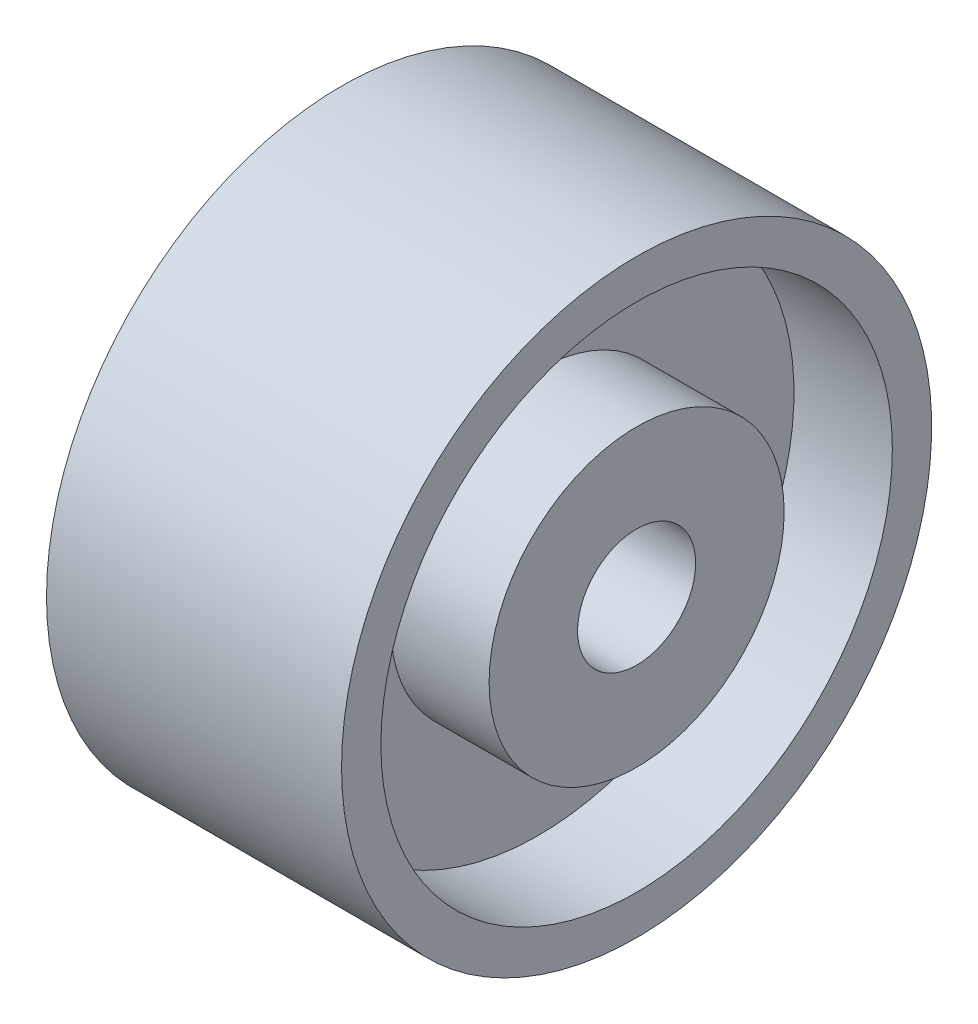
ISO-10303-21;
HEADER;
FILE_DESCRIPTION(('STEP AP214'),'2;1');
FILE_NAME('part.step','',(''),(''),'','','');
FILE_SCHEMA(('AUTOMOTIVE_DESIGN { 1 0 10303 214 1 1 1 1 }'));
ENDSEC;
DATA;
#1=APPLICATION_CONTEXT('core data for automotive mechanical design processes');
#2=APPLICATION_PROTOCOL_DEFINITION('international standard','automotive_design',2000,#1);
#3=PRODUCT_CONTEXT('',#1,'mechanical');
#4=PRODUCT('Part','Part','',(#3));
#5=PRODUCT_RELATED_PRODUCT_CATEGORY('part','',(#4));
#6=PRODUCT_DEFINITION_FORMATION('','',#4);
#7=PRODUCT_DEFINITION_CONTEXT('part definition',#1,'design');
#8=PRODUCT_DEFINITION('design','',#6,#7);
#9=PRODUCT_DEFINITION_SHAPE('','',#8);
#10=(LENGTH_UNIT() NAMED_UNIT(*) SI_UNIT(.MILLI.,.METRE.));
#11=(NAMED_UNIT(*) PLANE_ANGLE_UNIT() SI_UNIT($,.RADIAN.));
#12=(NAMED_UNIT(*) SI_UNIT($,.STERADIAN.) SOLID_ANGLE_UNIT());
#13=UNCERTAINTY_MEASURE_WITH_UNIT(LENGTH_MEASURE(1.E-05),#10,'distance_accuracy_value','');
#14=(GEOMETRIC_REPRESENTATION_CONTEXT(3) GLOBAL_UNCERTAINTY_ASSIGNED_CONTEXT((#13)) GLOBAL_UNIT_ASSIGNED_CONTEXT((#10,
#11,#12)) REPRESENTATION_CONTEXT('',''));
#15=CARTESIAN_POINT('',(0.,0.,0.));
#16=DIRECTION('',(0.,0.,1.));
#17=DIRECTION('',(1.,0.,0.));
#18=AXIS2_PLACEMENT_3D('',#15,#16,#17);
#19=CARTESIAN_POINT('',(15.,0.,0.));
#20=DIRECTION('',(-1.,0.,0.));
#21=DIRECTION('',(0.,0.,1.));
#22=AXIS2_PLACEMENT_3D('',#19,#20,#21);
#23=CYLINDRICAL_SURFACE('',#22,15.);
#24=CARTESIAN_POINT('',(10.,0.,0.));
#25=DIRECTION('',(-1.,0.,0.));
#26=DIRECTION('',(0.,0.,1.));
#27=AXIS2_PLACEMENT_3D('',#24,#25,#26);
#28=CIRCLE('',#27,15.);
#29=CARTESIAN_POINT('',(10.,0.,15.));
#30=VERTEX_POINT('',#29);
#31=EDGE_CURVE('E45',#30,#30,#28,.T.);
#32=ORIENTED_EDGE('',*,*,#31,.T.);
#33=EDGE_LOOP('',(#32));
#34=FACE_BOUND('',#33,.T.);
#35=CARTESIAN_POINT('',(0.,0.,0.));
#36=DIRECTION('',(-1.,0.,0.));
#37=DIRECTION('',(0.,0.,1.));
#38=AXIS2_PLACEMENT_3D('',#35,#36,#37);
#39=CIRCLE('',#38,15.);
#40=CARTESIAN_POINT('',(0.,0.,15.));
#41=VERTEX_POINT('',#40);
#42=EDGE_CURVE('E81',#41,#41,#39,.T.);
#43=ORIENTED_EDGE('',*,*,#42,.F.);
#44=EDGE_LOOP('',(#43));
#45=FACE_BOUND('',#44,.T.);
#46=ADVANCED_FACE('F37',(#34,#45),#23,.T.);
#47=CARTESIAN_POINT('',(15.,0.,0.));
#48=DIRECTION('',(-1.,0.,0.));
#49=DIRECTION('',(0.,0.,1.));
#50=AXIS2_PLACEMENT_3D('',#47,#48,#49);
#51=CYLINDRICAL_SURFACE('',#50,26.);
#52=CARTESIAN_POINT('',(30.,0.,0.));
#53=DIRECTION('',(1.,0.,0.));
#54=DIRECTION('',(0.,0.,-1.));
#55=AXIS2_PLACEMENT_3D('',#52,#53,#54);
#56=CIRCLE('',#55,26.);
#57=CARTESIAN_POINT('',(30.,0.,-26.));
#58=VERTEX_POINT('',#57);
#59=EDGE_CURVE('E61',#58,#58,#56,.F.);
#60=ORIENTED_EDGE('',*,*,#59,.F.);
#61=EDGE_LOOP('',(#60));
#62=FACE_BOUND('',#61,.T.);
#63=CARTESIAN_POINT('',(20.,0.,0.));
#64=DIRECTION('',(-1.,0.,0.));
#65=DIRECTION('',(0.,0.,1.));
#66=AXIS2_PLACEMENT_3D('',#63,#64,#65);
#67=CIRCLE('',#66,26.);
#68=CARTESIAN_POINT('',(20.,0.,26.));
#69=VERTEX_POINT('',#68);
#70=EDGE_CURVE('E50',#69,#69,#67,.F.);
#71=ORIENTED_EDGE('',*,*,#70,.F.);
#72=EDGE_LOOP('',(#71));
#73=FACE_BOUND('',#72,.T.);
#74=ADVANCED_FACE('F117',(#62,#73),#51,.F.);
#75=CARTESIAN_POINT('',(30.,0.,0.));
#76=DIRECTION('',(-1.,0.,0.));
#77=DIRECTION('',(0.,0.,1.));
#78=AXIS2_PLACEMENT_3D('',#75,#76,#77);
#79=CYLINDRICAL_SURFACE('',#78,30.);
#80=CARTESIAN_POINT('',(30.,0.,0.));
#81=DIRECTION('',(-1.,0.,0.));
#82=DIRECTION('',(0.,0.,1.));
#83=AXIS2_PLACEMENT_3D('',#80,#81,#82);
#84=CIRCLE('',#83,30.);
#85=CARTESIAN_POINT('',(30.,0.,30.));
#86=VERTEX_POINT('',#85);
#87=EDGE_CURVE('E62',#86,#86,#84,.T.);
#88=ORIENTED_EDGE('',*,*,#87,.T.);
#89=EDGE_LOOP('',(#88));
#90=FACE_BOUND('',#89,.T.);
#91=CARTESIAN_POINT('',(0.,0.,0.));
#92=DIRECTION('',(-1.,0.,0.));
#93=DIRECTION('',(0.,0.,1.));
#94=AXIS2_PLACEMENT_3D('',#91,#92,#93);
#95=CIRCLE('',#94,30.);
#96=CARTESIAN_POINT('',(0.,0.,30.));
#97=VERTEX_POINT('',#96);
#98=EDGE_CURVE('E66',#97,#97,#95,.T.);
#99=ORIENTED_EDGE('',*,*,#98,.F.);
#100=EDGE_LOOP('',(#99));
#101=FACE_BOUND('',#100,.T.);
#102=ADVANCED_FACE('F122',(#90,#101),#79,.T.);
#103=CARTESIAN_POINT('',(0.,0.,0.));
#104=DIRECTION('',(1.,0.,0.));
#105=DIRECTION('',(0.,0.,-1.));
#106=AXIS2_PLACEMENT_3D('',#103,#104,#105);
#107=PLANE('',#106);
#108=CARTESIAN_POINT('',(0.,0.,0.));
#109=DIRECTION('',(-1.,0.,0.));
#110=DIRECTION('',(0.,0.,1.));
#111=AXIS2_PLACEMENT_3D('',#108,#109,#110);
#112=CIRCLE('',#111,26.);
#113=CARTESIAN_POINT('',(0.,0.,26.));
#114=VERTEX_POINT('',#113);
#115=EDGE_CURVE('E55',#114,#114,#112,.T.);
#116=ORIENTED_EDGE('',*,*,#115,.F.);
#117=EDGE_LOOP('',(#116));
#118=FACE_BOUND('',#117,.T.);
#119=ORIENTED_EDGE('',*,*,#98,.T.);
#120=EDGE_LOOP('',(#119));
#121=FACE_BOUND('',#120,.T.);
#122=ADVANCED_FACE('F133',(#118,#121),#107,.F.);
#123=CARTESIAN_POINT('',(30.,0.,0.));
#124=DIRECTION('',(1.,0.,0.));
#125=DIRECTION('',(0.,0.,-1.));
#126=AXIS2_PLACEMENT_3D('',#123,#124,#125);
#127=PLANE('',#126);
#128=ORIENTED_EDGE('',*,*,#59,.T.);
#129=EDGE_LOOP('',(#128));
#130=FACE_BOUND('',#129,.T.);
#131=ORIENTED_EDGE('',*,*,#87,.F.);
#132=EDGE_LOOP('',(#131));
#133=FACE_BOUND('',#132,.T.);
#134=ADVANCED_FACE('F136',(#130,#133),#127,.T.);
#135=CARTESIAN_POINT('',(10.,0.,0.));
#136=DIRECTION('',(-1.,0.,0.));
#137=DIRECTION('',(0.,0.,1.));
#138=AXIS2_PLACEMENT_3D('',#135,#136,#137);
#139=CIRCLE('',#138,26.);
#140=CARTESIAN_POINT('',(10.,0.,26.));
#141=VERTEX_POINT('',#140);
#142=EDGE_CURVE('E67',#141,#141,#139,.T.);
#143=ORIENTED_EDGE('',*,*,#142,.F.);
#144=EDGE_LOOP('',(#143));
#145=FACE_BOUND('',#144,.T.);
#146=ORIENTED_EDGE('',*,*,#115,.T.);
#147=EDGE_LOOP('',(#146));
#148=FACE_BOUND('',#147,.T.);
#149=ADVANCED_FACE('F39',(#145,#148),#51,.F.);
#150=CARTESIAN_POINT('',(10.,0.,0.));
#151=DIRECTION('',(-1.,0.,0.));
#152=DIRECTION('',(0.,0.,1.));
#153=AXIS2_PLACEMENT_3D('',#150,#151,#152);
#154=PLANE('',#153);
#155=ORIENTED_EDGE('',*,*,#31,.F.);
#156=EDGE_LOOP('',(#155));
#157=FACE_BOUND('',#156,.T.);
#158=ORIENTED_EDGE('',*,*,#142,.T.);
#159=EDGE_LOOP('',(#158));
#160=FACE_BOUND('',#159,.T.);
#161=ADVANCED_FACE('F126',(#157,#160),#154,.T.);
#162=CARTESIAN_POINT('',(20.,0.,0.));
#163=DIRECTION('',(-1.,0.,0.));
#164=DIRECTION('',(0.,0.,1.));
#165=AXIS2_PLACEMENT_3D('',#162,#163,#164);
#166=PLANE('',#165);
#167=CARTESIAN_POINT('',(20.,0.,0.));
#168=DIRECTION('',(-1.,0.,0.));
#169=DIRECTION('',(0.,0.,1.));
#170=AXIS2_PLACEMENT_3D('',#167,#168,#169);
#171=CIRCLE('',#170,15.);
#172=CARTESIAN_POINT('',(20.,0.,15.));
#173=VERTEX_POINT('',#172);
#174=EDGE_CURVE('E10',#173,#173,#171,.F.);
#175=ORIENTED_EDGE('',*,*,#174,.F.);
#176=EDGE_LOOP('',(#175));
#177=FACE_BOUND('',#176,.T.);
#178=ORIENTED_EDGE('',*,*,#70,.T.);
#179=EDGE_LOOP('',(#178));
#180=FACE_BOUND('',#179,.T.);
#181=ADVANCED_FACE('F113',(#177,#180),#166,.F.);
#182=CARTESIAN_POINT('',(30.,0.,0.));
#183=DIRECTION('',(-1.,0.,0.));
#184=DIRECTION('',(0.,0.,1.));
#185=AXIS2_PLACEMENT_3D('',#182,#183,#184);
#186=CYLINDRICAL_SURFACE('',#185,15.);
#187=CARTESIAN_POINT('',(30.,0.,0.));
#188=DIRECTION('',(1.,0.,0.));
#189=DIRECTION('',(0.,0.,-1.));
#190=AXIS2_PLACEMENT_3D('',#187,#188,#189);
#191=CIRCLE('',#190,15.);
#192=CARTESIAN_POINT('',(30.,0.,-15.));
#193=VERTEX_POINT('',#192);
#194=EDGE_CURVE('E77',#193,#193,#191,.T.);
#195=ORIENTED_EDGE('',*,*,#194,.F.);
#196=EDGE_LOOP('',(#195));
#197=FACE_BOUND('',#196,.T.);
#198=ORIENTED_EDGE('',*,*,#174,.T.);
#199=EDGE_LOOP('',(#198));
#200=FACE_BOUND('',#199,.T.);
#201=ADVANCED_FACE('F104',(#197,#200),#186,.T.);
#202=CARTESIAN_POINT('',(30.,0.,0.));
#203=DIRECTION('',(1.,0.,0.));
#204=DIRECTION('',(0.,0.,-1.));
#205=AXIS2_PLACEMENT_3D('',#202,#203,#204);
#206=PLANE('',#205);
#207=ORIENTED_EDGE('',*,*,#194,.T.);
#208=EDGE_LOOP('',(#207));
#209=FACE_BOUND('',#208,.T.);
#210=CARTESIAN_POINT('',(30.,0.,0.));
#211=DIRECTION('',(1.,0.,0.));
#212=DIRECTION('',(0.,0.,-1.));
#213=AXIS2_PLACEMENT_3D('',#210,#211,#212);
#214=CIRCLE('',#213,6.);
#215=CARTESIAN_POINT('',(30.,0.,-6.));
#216=VERTEX_POINT('',#215);
#217=EDGE_CURVE('E86',#216,#216,#214,.T.);
#218=ORIENTED_EDGE('',*,*,#217,.F.);
#219=EDGE_LOOP('',(#218));
#220=FACE_BOUND('',#219,.T.);
#221=ADVANCED_FACE('F102',(#209,#220),#206,.T.);
#222=CARTESIAN_POINT('',(0.,0.,0.));
#223=DIRECTION('',(-1.,0.,0.));
#224=DIRECTION('',(0.,0.,1.));
#225=AXIS2_PLACEMENT_3D('',#222,#223,#224);
#226=PLANE('',#225);
#227=ORIENTED_EDGE('',*,*,#42,.T.);
#228=EDGE_LOOP('',(#227));
#229=FACE_BOUND('',#228,.T.);
#230=CARTESIAN_POINT('',(0.,0.,0.));
#231=DIRECTION('',(1.,0.,0.));
#232=DIRECTION('',(0.,0.,-1.));
#233=AXIS2_PLACEMENT_3D('',#230,#231,#232);
#234=CIRCLE('',#233,6.);
#235=CARTESIAN_POINT('',(0.,0.,-6.));
#236=VERTEX_POINT('',#235);
#237=EDGE_CURVE('E85',#236,#236,#234,.T.);
#238=ORIENTED_EDGE('',*,*,#237,.T.);
#239=EDGE_LOOP('',(#238));
#240=FACE_BOUND('',#239,.T.);
#241=ADVANCED_FACE('F94',(#229,#240),#226,.T.);
#242=CARTESIAN_POINT('',(58.2842712474619,0.,0.));
#243=DIRECTION('',(-1.,0.,0.));
#244=DIRECTION('',(0.,0.,1.));
#245=AXIS2_PLACEMENT_3D('',#242,#243,#244);
#246=CYLINDRICAL_SURFACE('',#245,6.);
#247=ORIENTED_EDGE('',*,*,#237,.F.);
#248=EDGE_LOOP('',(#247));
#249=FACE_BOUND('',#248,.T.);
#250=ORIENTED_EDGE('',*,*,#217,.T.);
#251=EDGE_LOOP('',(#250));
#252=FACE_BOUND('',#251,.T.);
#253=ADVANCED_FACE('F96',(#249,#252),#246,.F.);
#254=CLOSED_SHELL('',(#46,#74,#102,#122,#134,#149,#161,#181,#201,#221,#241,#253));
#255=MANIFOLD_SOLID_BREP('B2',#254);
#256=ADVANCED_BREP_SHAPE_REPRESENTATION('',(#18,#255),#14);
#257=SHAPE_DEFINITION_REPRESENTATION(#9,#256);
ENDSEC;
END-ISO-10303-21;
